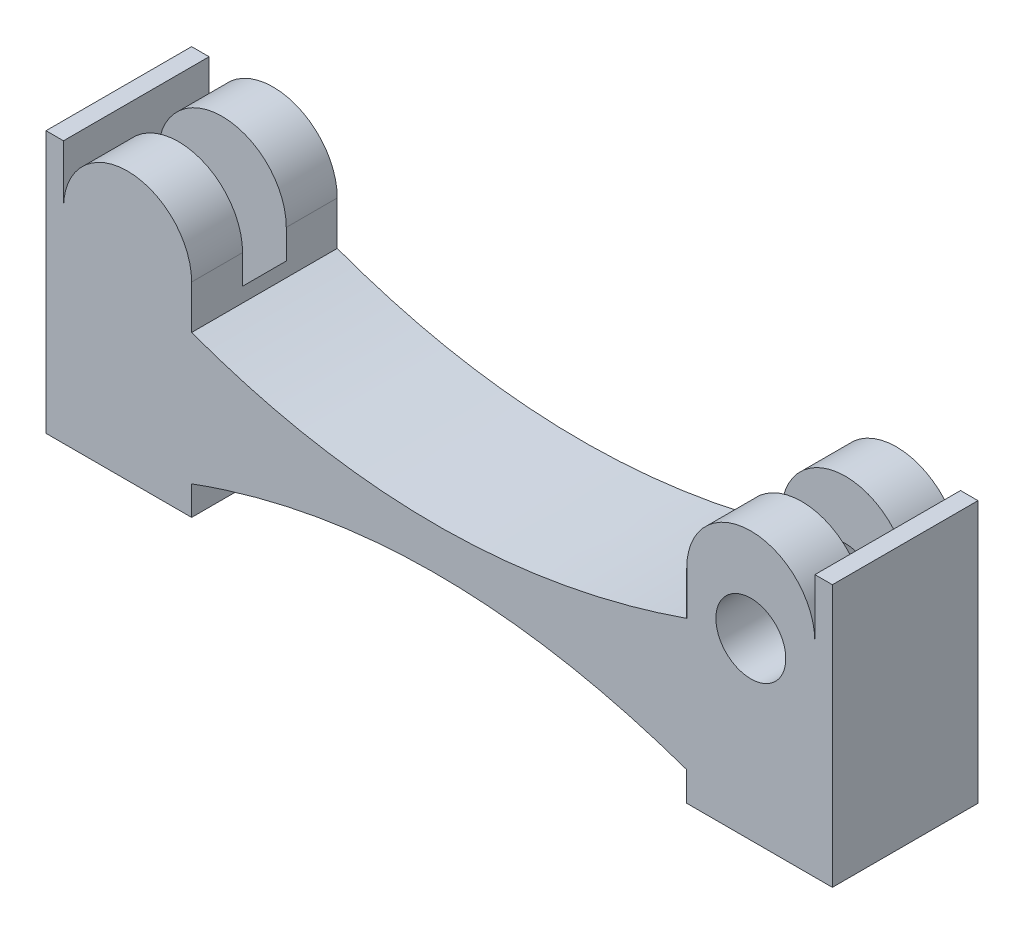
ISO-10303-21;
HEADER;
FILE_DESCRIPTION(('STEP AP214'),'2;1');
FILE_NAME('part.step','',(''),(''),'','','');
FILE_SCHEMA(('AUTOMOTIVE_DESIGN { 1 0 10303 214 1 1 1 1 }'));
ENDSEC;
DATA;
#1=APPLICATION_CONTEXT('core data for automotive mechanical design processes');
#2=APPLICATION_PROTOCOL_DEFINITION('international standard','automotive_design',2000,#1);
#3=PRODUCT_CONTEXT('',#1,'mechanical');
#4=PRODUCT('Part','Part','',(#3));
#5=PRODUCT_RELATED_PRODUCT_CATEGORY('part','',(#4));
#6=PRODUCT_DEFINITION_FORMATION('','',#4);
#7=PRODUCT_DEFINITION_CONTEXT('part definition',#1,'design');
#8=PRODUCT_DEFINITION('design','',#6,#7);
#9=PRODUCT_DEFINITION_SHAPE('','',#8);
#10=(LENGTH_UNIT() NAMED_UNIT(*) SI_UNIT(.MILLI.,.METRE.));
#11=(NAMED_UNIT(*) PLANE_ANGLE_UNIT() SI_UNIT($,.RADIAN.));
#12=(NAMED_UNIT(*) SI_UNIT($,.STERADIAN.) SOLID_ANGLE_UNIT());
#13=UNCERTAINTY_MEASURE_WITH_UNIT(LENGTH_MEASURE(1.E-05),#10,'distance_accuracy_value','');
#14=(GEOMETRIC_REPRESENTATION_CONTEXT(3) GLOBAL_UNCERTAINTY_ASSIGNED_CONTEXT((#13)) GLOBAL_UNIT_ASSIGNED_CONTEXT((#10,
#11,#12)) REPRESENTATION_CONTEXT('',''));
#15=CARTESIAN_POINT('',(0.,0.,0.));
#16=DIRECTION('',(0.,0.,1.));
#17=DIRECTION('',(1.,0.,0.));
#18=AXIS2_PLACEMENT_3D('',#15,#16,#17);
#19=CARTESIAN_POINT('',(11.,30.,0.));
#20=DIRECTION('',(0.,0.,-1.));
#21=DIRECTION('',(-1.,0.,0.));
#22=AXIS2_PLACEMENT_3D('',#19,#20,#21);
#23=PLANE('',#22);
#24=CARTESIAN_POINT('',(11.,30.,0.));
#25=DIRECTION('',(0.,0.,-1.));
#26=DIRECTION('',(-1.,0.,0.));
#27=AXIS2_PLACEMENT_3D('',#24,#25,#26);
#28=CIRCLE('',#27,6.);
#29=CARTESIAN_POINT('',(5.,30.,0.));
#30=VERTEX_POINT('',#29);
#31=EDGE_CURVE('E46',#30,#30,#28,.T.);
#32=ORIENTED_EDGE('',*,*,#31,.T.);
#33=EDGE_LOOP('',(#32));
#34=FACE_BOUND('',#33,.T.);
#35=DIRECTION('',(0.,1.,0.));
#36=VECTOR('',#35,1.);
#37=CARTESIAN_POINT('',(0.,30.,0.));
#38=LINE('',#37,#36);
#39=CARTESIAN_POINT('',(0.,27.5,0.));
#40=VERTEX_POINT('',#39);
#41=CARTESIAN_POINT('',(0.,35.,0.));
#42=VERTEX_POINT('',#41);
#43=EDGE_CURVE('E433',#40,#42,#38,.T.);
#44=ORIENTED_EDGE('',*,*,#43,.F.);
#45=CARTESIAN_POINT('',(-85.,27.5,0.));
#46=CARTESIAN_POINT('',(-43.5735742321877,12.2657288947168,0.));
#47=CARTESIAN_POINT('',(0.,27.5,0.));
#48=B_SPLINE_CURVE_WITH_KNOTS('',2,(#45,#46,#47),.UNSPECIFIED.,.F.,.F.,(3,3),(0.,1.),.UNSPECIFIED.);
#49=CARTESIAN_POINT('',(-85.,27.5,0.));
#50=VERTEX_POINT('',#49);
#51=EDGE_CURVE('E348',#50,#40,#48,.T.);
#52=ORIENTED_EDGE('',*,*,#51,.F.);
#53=DIRECTION('',(0.,-1.,0.));
#54=VECTOR('',#53,1.);
#55=CARTESIAN_POINT('',(-85.,0.,0.));
#56=LINE('',#55,#54);
#57=CARTESIAN_POINT('',(-85.,35.,0.));
#58=VERTEX_POINT('',#57);
#59=EDGE_CURVE('E331',#58,#50,#56,.T.);
#60=ORIENTED_EDGE('',*,*,#59,.F.);
#61=CARTESIAN_POINT('',(-96.,35.,0.));
#62=DIRECTION('',(0.,0.,-1.));
#63=DIRECTION('',(-1.,0.,0.));
#64=AXIS2_PLACEMENT_3D('',#61,#62,#63);
#65=CIRCLE('',#64,11.);
#66=CARTESIAN_POINT('',(-107.,35.,0.));
#67=VERTEX_POINT('',#66);
#68=EDGE_CURVE('E261',#67,#58,#65,.T.);
#69=ORIENTED_EDGE('',*,*,#68,.F.);
#70=DIRECTION('',(0.,-1.,0.));
#71=VECTOR('',#70,1.);
#72=CARTESIAN_POINT('',(-107.,0.,0.));
#73=LINE('',#72,#71);
#74=CARTESIAN_POINT('',(-107.,45.,0.));
#75=VERTEX_POINT('',#74);
#76=EDGE_CURVE('E236',#75,#67,#73,.T.);
#77=ORIENTED_EDGE('',*,*,#76,.F.);
#78=DIRECTION('',(1.,0.,0.));
#79=VECTOR('',#78,1.);
#80=CARTESIAN_POINT('',(-107.,45.,0.));
#81=LINE('',#80,#79);
#82=CARTESIAN_POINT('',(-110.,45.,0.));
#83=VERTEX_POINT('',#82);
#84=EDGE_CURVE('E243',#83,#75,#81,.T.);
#85=ORIENTED_EDGE('',*,*,#84,.F.);
#86=DIRECTION('',(0.,1.,0.));
#87=VECTOR('',#86,1.);
#88=CARTESIAN_POINT('',(-110.,0.,0.));
#89=LINE('',#88,#87);
#90=CARTESIAN_POINT('',(-110.,0.,0.));
#91=VERTEX_POINT('',#90);
#92=EDGE_CURVE('E239',#91,#83,#89,.T.);
#93=ORIENTED_EDGE('',*,*,#92,.F.);
#94=DIRECTION('',(-1.,0.,0.));
#95=VECTOR('',#94,1.);
#96=CARTESIAN_POINT('',(-85.,0.,0.));
#97=LINE('',#96,#95);
#98=CARTESIAN_POINT('',(-85.,0.,0.));
#99=VERTEX_POINT('',#98);
#100=EDGE_CURVE('E333',#99,#91,#97,.T.);
#101=ORIENTED_EDGE('',*,*,#100,.F.);
#102=CARTESIAN_POINT('',(-85.,5.,0.));
#103=VERTEX_POINT('',#102);
#104=EDGE_CURVE('E334',#103,#99,#56,.T.);
#105=ORIENTED_EDGE('',*,*,#104,.F.);
#106=CARTESIAN_POINT('',(0.,5.,0.));
#107=CARTESIAN_POINT('',(-43.4351216094378,20.2349120752058,0.));
#108=CARTESIAN_POINT('',(-85.,5.,0.));
#109=B_SPLINE_CURVE_WITH_KNOTS('',2,(#106,#107,#108),.UNSPECIFIED.,.F.,.F.,(3,3),(0.,1.),.UNSPECIFIED.);
#110=CARTESIAN_POINT('',(0.,5.,0.));
#111=VERTEX_POINT('',#110);
#112=EDGE_CURVE('E354',#111,#103,#109,.T.);
#113=ORIENTED_EDGE('',*,*,#112,.F.);
#114=DIRECTION('',(0.,-1.,0.));
#115=VECTOR('',#114,1.);
#116=CARTESIAN_POINT('',(0.,30.,0.));
#117=LINE('',#116,#115);
#118=CARTESIAN_POINT('',(0.,0.,0.));
#119=VERTEX_POINT('',#118);
#120=EDGE_CURVE('E419',#111,#119,#117,.T.);
#121=ORIENTED_EDGE('',*,*,#120,.T.);
#122=DIRECTION('',(1.,0.,0.));
#123=VECTOR('',#122,1.);
#124=CARTESIAN_POINT('',(0.,0.,0.));
#125=LINE('',#124,#123);
#126=CARTESIAN_POINT('',(25.,0.,0.));
#127=VERTEX_POINT('',#126);
#128=EDGE_CURVE('E207',#119,#127,#125,.T.);
#129=ORIENTED_EDGE('',*,*,#128,.T.);
#130=DIRECTION('',(0.,-1.,0.));
#131=VECTOR('',#130,1.);
#132=CARTESIAN_POINT('',(25.,0.,0.));
#133=LINE('',#132,#131);
#134=CARTESIAN_POINT('',(25.,45.,0.));
#135=VERTEX_POINT('',#134);
#136=EDGE_CURVE('E215',#135,#127,#133,.T.);
#137=ORIENTED_EDGE('',*,*,#136,.F.);
#138=DIRECTION('',(1.,0.,0.));
#139=VECTOR('',#138,1.);
#140=CARTESIAN_POINT('',(22.,45.,0.));
#141=LINE('',#140,#139);
#142=CARTESIAN_POINT('',(22.,45.,0.));
#143=VERTEX_POINT('',#142);
#144=EDGE_CURVE('E226',#143,#135,#141,.T.);
#145=ORIENTED_EDGE('',*,*,#144,.F.);
#146=DIRECTION('',(0.,1.,0.));
#147=VECTOR('',#146,1.);
#148=CARTESIAN_POINT('',(22.,0.,0.));
#149=LINE('',#148,#147);
#150=CARTESIAN_POINT('',(22.,35.,0.));
#151=VERTEX_POINT('',#150);
#152=EDGE_CURVE('E222',#151,#143,#149,.T.);
#153=ORIENTED_EDGE('',*,*,#152,.F.);
#154=CARTESIAN_POINT('',(11.,35.,0.));
#155=DIRECTION('',(0.,0.,-1.));
#156=DIRECTION('',(-1.,0.,0.));
#157=AXIS2_PLACEMENT_3D('',#154,#155,#156);
#158=CIRCLE('',#157,11.);
#159=EDGE_CURVE('E427',#42,#151,#158,.T.);
#160=ORIENTED_EDGE('',*,*,#159,.F.);
#161=EDGE_LOOP('',(#44,#52,#60,#69,#77,#85,#93,#101,#105,#113,#121,#129,#137,#145,#153,#160));
#162=FACE_BOUND('',#161,.T.);
#163=ADVANCED_FACE('F38',(#34,#162),#23,.F.);
#164=CARTESIAN_POINT('',(11.,30.,0.));
#165=DIRECTION('',(0.,0.,-1.));
#166=DIRECTION('',(-1.,0.,0.));
#167=AXIS2_PLACEMENT_3D('',#164,#165,#166);
#168=CYLINDRICAL_SURFACE('',#167,6.);
#169=ORIENTED_EDGE('',*,*,#31,.F.);
#170=EDGE_LOOP('',(#169));
#171=FACE_BOUND('',#170,.T.);
#172=CARTESIAN_POINT('',(11.,30.,-8.75));
#173=DIRECTION('',(0.,0.,-1.));
#174=DIRECTION('',(-1.,0.,0.));
#175=AXIS2_PLACEMENT_3D('',#172,#173,#174);
#176=CIRCLE('',#175,6.);
#177=CARTESIAN_POINT('',(5.,30.,-8.75));
#178=VERTEX_POINT('',#177);
#179=EDGE_CURVE('E11',#178,#178,#176,.F.);
#180=ORIENTED_EDGE('',*,*,#179,.F.);
#181=EDGE_LOOP('',(#180));
#182=FACE_BOUND('',#181,.T.);
#183=ADVANCED_FACE('F388',(#171,#182),#168,.F.);
#184=CARTESIAN_POINT('',(11.,30.,-8.75));
#185=DIRECTION('',(0.,0.,-1.));
#186=DIRECTION('',(-1.,0.,0.));
#187=AXIS2_PLACEMENT_3D('',#184,#185,#186);
#188=PLANE('',#187);
#189=ORIENTED_EDGE('',*,*,#179,.T.);
#190=EDGE_LOOP('',(#189));
#191=FACE_BOUND('',#190,.T.);
#192=CARTESIAN_POINT('',(11.,30.,-8.75));
#193=DIRECTION('',(0.,0.,-1.));
#194=DIRECTION('',(-1.,0.,0.));
#195=AXIS2_PLACEMENT_3D('',#192,#193,#194);
#196=CIRCLE('',#195,11.);
#197=CARTESIAN_POINT('',(22.,30.,-8.75));
#198=VERTEX_POINT('',#197);
#199=CARTESIAN_POINT('',(0.,30.,-8.75));
#200=VERTEX_POINT('',#199);
#201=EDGE_CURVE('E311',#198,#200,#196,.T.);
#202=ORIENTED_EDGE('',*,*,#201,.T.);
#203=DIRECTION('',(0.,1.,0.));
#204=VECTOR('',#203,1.);
#205=CARTESIAN_POINT('',(0.,30.,-8.75));
#206=LINE('',#205,#204);
#207=CARTESIAN_POINT('',(0.,35.,-8.75));
#208=VERTEX_POINT('',#207);
#209=EDGE_CURVE('E436',#200,#208,#206,.T.);
#210=ORIENTED_EDGE('',*,*,#209,.T.);
#211=CARTESIAN_POINT('',(11.,35.,-8.75));
#212=DIRECTION('',(0.,0.,-1.));
#213=DIRECTION('',(-1.,0.,0.));
#214=AXIS2_PLACEMENT_3D('',#211,#212,#213);
#215=CIRCLE('',#214,11.);
#216=CARTESIAN_POINT('',(22.,35.,-8.75));
#217=VERTEX_POINT('',#216);
#218=EDGE_CURVE('E432',#208,#217,#215,.T.);
#219=ORIENTED_EDGE('',*,*,#218,.T.);
#220=DIRECTION('',(0.,-1.,0.));
#221=VECTOR('',#220,1.);
#222=CARTESIAN_POINT('',(22.,35.,-8.75));
#223=LINE('',#222,#221);
#224=EDGE_CURVE('E429',#217,#198,#223,.T.);
#225=ORIENTED_EDGE('',*,*,#224,.T.);
#226=EDGE_LOOP('',(#202,#210,#219,#225));
#227=FACE_BOUND('',#226,.T.);
#228=ADVANCED_FACE('F385',(#191,#227),#188,.T.);
#229=CARTESIAN_POINT('',(11.,35.,0.));
#230=DIRECTION('',(0.,0.,-1.));
#231=DIRECTION('',(-1.,0.,0.));
#232=AXIS2_PLACEMENT_3D('',#229,#230,#231);
#233=CYLINDRICAL_SURFACE('',#232,11.);
#234=ORIENTED_EDGE('',*,*,#218,.F.);
#235=DIRECTION('',(0.,0.,-1.));
#236=VECTOR('',#235,1.);
#237=CARTESIAN_POINT('',(0.,35.,0.));
#238=LINE('',#237,#236);
#239=EDGE_CURVE('E52',#42,#208,#238,.T.);
#240=ORIENTED_EDGE('',*,*,#239,.F.);
#241=ORIENTED_EDGE('',*,*,#159,.T.);
#242=DIRECTION('',(0.,0.,-1.));
#243=VECTOR('',#242,1.);
#244=CARTESIAN_POINT('',(22.,35.,0.));
#245=LINE('',#244,#243);
#246=EDGE_CURVE('E418',#151,#217,#245,.T.);
#247=ORIENTED_EDGE('',*,*,#246,.T.);
#248=EDGE_LOOP('',(#234,#240,#241,#247));
#249=FACE_BOUND('',#248,.T.);
#250=ADVANCED_FACE('F382',(#249),#233,.T.);
#251=CARTESIAN_POINT('',(0.,30.,0.));
#252=DIRECTION('',(-1.,0.,0.));
#253=DIRECTION('',(0.,0.,1.));
#254=AXIS2_PLACEMENT_3D('',#251,#252,#253);
#255=PLANE('',#254);
#256=ORIENTED_EDGE('',*,*,#209,.F.);
#257=DIRECTION('',(0.,0.,1.));
#258=VECTOR('',#257,1.);
#259=CARTESIAN_POINT('',(0.,30.,-16.25));
#260=LINE('',#259,#258);
#261=CARTESIAN_POINT('',(0.,30.,-16.25));
#262=VERTEX_POINT('',#261);
#263=EDGE_CURVE('E324',#200,#262,#260,.F.);
#264=ORIENTED_EDGE('',*,*,#263,.T.);
#265=DIRECTION('',(0.,1.,0.));
#266=VECTOR('',#265,1.);
#267=CARTESIAN_POINT('',(0.,35.,-16.25));
#268=LINE('',#267,#266);
#269=CARTESIAN_POINT('',(0.,35.,-16.25));
#270=VERTEX_POINT('',#269);
#271=EDGE_CURVE('E281',#262,#270,#268,.T.);
#272=ORIENTED_EDGE('',*,*,#271,.T.);
#273=DIRECTION('',(0.,0.,-1.));
#274=VECTOR('',#273,1.);
#275=CARTESIAN_POINT('',(0.,35.,-16.25));
#276=LINE('',#275,#274);
#277=CARTESIAN_POINT('',(0.,35.,-25.));
#278=VERTEX_POINT('',#277);
#279=EDGE_CURVE('E287',#270,#278,#276,.T.);
#280=ORIENTED_EDGE('',*,*,#279,.T.);
#281=DIRECTION('',(0.,-1.,0.));
#282=VECTOR('',#281,1.);
#283=CARTESIAN_POINT('',(0.,30.,-25.));
#284=LINE('',#283,#282);
#285=CARTESIAN_POINT('',(0.,27.5,-25.));
#286=VERTEX_POINT('',#285);
#287=EDGE_CURVE('E423',#278,#286,#284,.T.);
#288=ORIENTED_EDGE('',*,*,#287,.T.);
#289=DIRECTION('',(0.,0.,-1.));
#290=VECTOR('',#289,1.);
#291=CARTESIAN_POINT('',(0.,27.5,0.));
#292=LINE('',#291,#290);
#293=EDGE_CURVE('E449',#40,#286,#292,.T.);
#294=ORIENTED_EDGE('',*,*,#293,.F.);
#295=ORIENTED_EDGE('',*,*,#43,.T.);
#296=ORIENTED_EDGE('',*,*,#239,.T.);
#297=EDGE_LOOP('',(#256,#264,#272,#280,#288,#294,#295,#296));
#298=FACE_BOUND('',#297,.T.);
#299=ADVANCED_FACE('F378',(#298),#255,.T.);
#300=CARTESIAN_POINT('',(0.,30.,0.));
#301=DIRECTION('',(1.,0.,0.));
#302=DIRECTION('',(0.,0.,-1.));
#303=AXIS2_PLACEMENT_3D('',#300,#301,#302);
#304=PLANE('',#303);
#305=ORIENTED_EDGE('',*,*,#120,.F.);
#306=DIRECTION('',(0.,0.,-1.));
#307=VECTOR('',#306,1.);
#308=CARTESIAN_POINT('',(0.,5.,0.));
#309=LINE('',#308,#307);
#310=CARTESIAN_POINT('',(0.,5.,-25.));
#311=VERTEX_POINT('',#310);
#312=EDGE_CURVE('E453',#111,#311,#309,.T.);
#313=ORIENTED_EDGE('',*,*,#312,.T.);
#314=CARTESIAN_POINT('',(0.,0.,-25.));
#315=VERTEX_POINT('',#314);
#316=EDGE_CURVE('E463',#311,#315,#284,.T.);
#317=ORIENTED_EDGE('',*,*,#316,.T.);
#318=DIRECTION('',(0.,0.,1.));
#319=VECTOR('',#318,1.);
#320=CARTESIAN_POINT('',(0.,0.,0.));
#321=LINE('',#320,#319);
#322=EDGE_CURVE('E202',#315,#119,#321,.T.);
#323=ORIENTED_EDGE('',*,*,#322,.T.);
#324=EDGE_LOOP('',(#305,#313,#317,#323));
#325=FACE_BOUND('',#324,.T.);
#326=ADVANCED_FACE('F375',(#325),#304,.F.);
#327=CARTESIAN_POINT('',(0.,30.,-25.));
#328=DIRECTION('',(0.,0.,1.));
#329=DIRECTION('',(1.,0.,0.));
#330=AXIS2_PLACEMENT_3D('',#327,#328,#329);
#331=PLANE('',#330);
#332=ORIENTED_EDGE('',*,*,#287,.F.);
#333=CARTESIAN_POINT('',(11.,35.,-25.));
#334=DIRECTION('',(0.,0.,-1.));
#335=DIRECTION('',(-1.,0.,0.));
#336=AXIS2_PLACEMENT_3D('',#333,#334,#335);
#337=CIRCLE('',#336,11.);
#338=CARTESIAN_POINT('',(22.,35.,-25.));
#339=VERTEX_POINT('',#338);
#340=EDGE_CURVE('E273',#278,#339,#337,.T.);
#341=ORIENTED_EDGE('',*,*,#340,.T.);
#342=DIRECTION('',(0.,1.,0.));
#343=VECTOR('',#342,1.);
#344=CARTESIAN_POINT('',(22.,0.,-25.));
#345=LINE('',#344,#343);
#346=CARTESIAN_POINT('',(22.,45.,-25.));
#347=VERTEX_POINT('',#346);
#348=EDGE_CURVE('E224',#339,#347,#345,.T.);
#349=ORIENTED_EDGE('',*,*,#348,.T.);
#350=DIRECTION('',(1.,0.,0.));
#351=VECTOR('',#350,1.);
#352=CARTESIAN_POINT('',(22.,45.,-25.));
#353=LINE('',#352,#351);
#354=CARTESIAN_POINT('',(25.,45.,-25.));
#355=VERTEX_POINT('',#354);
#356=EDGE_CURVE('E221',#347,#355,#353,.T.);
#357=ORIENTED_EDGE('',*,*,#356,.T.);
#358=DIRECTION('',(0.,-1.,0.));
#359=VECTOR('',#358,1.);
#360=CARTESIAN_POINT('',(25.,0.,-25.));
#361=LINE('',#360,#359);
#362=CARTESIAN_POINT('',(25.,0.,-25.));
#363=VERTEX_POINT('',#362);
#364=EDGE_CURVE('E212',#355,#363,#361,.T.);
#365=ORIENTED_EDGE('',*,*,#364,.T.);
#366=DIRECTION('',(-1.,0.,0.));
#367=VECTOR('',#366,1.);
#368=CARTESIAN_POINT('',(0.,0.,-25.));
#369=LINE('',#368,#367);
#370=EDGE_CURVE('E195',#363,#315,#369,.T.);
#371=ORIENTED_EDGE('',*,*,#370,.T.);
#372=ORIENTED_EDGE('',*,*,#316,.F.);
#373=CARTESIAN_POINT('',(0.,5.,-25.));
#374=CARTESIAN_POINT('',(-43.4351216094378,20.2349120752058,-25.));
#375=CARTESIAN_POINT('',(-85.,5.,-25.));
#376=B_SPLINE_CURVE_WITH_KNOTS('',2,(#373,#374,#375),.UNSPECIFIED.,.F.,.F.,(3,3),(0.,1.),.UNSPECIFIED.);
#377=CARTESIAN_POINT('',(-85.,5.,-25.));
#378=VERTEX_POINT('',#377);
#379=EDGE_CURVE('E355',#311,#378,#376,.T.);
#380=ORIENTED_EDGE('',*,*,#379,.T.);
#381=DIRECTION('',(0.,-1.,0.));
#382=VECTOR('',#381,1.);
#383=CARTESIAN_POINT('',(-85.,0.,-25.));
#384=LINE('',#383,#382);
#385=CARTESIAN_POINT('',(-85.,0.,-25.));
#386=VERTEX_POINT('',#385);
#387=EDGE_CURVE('E330',#378,#386,#384,.T.);
#388=ORIENTED_EDGE('',*,*,#387,.T.);
#389=DIRECTION('',(-1.,0.,0.));
#390=VECTOR('',#389,1.);
#391=CARTESIAN_POINT('',(-85.,0.,-25.));
#392=LINE('',#391,#390);
#393=CARTESIAN_POINT('',(-110.,0.,-25.));
#394=VERTEX_POINT('',#393);
#395=EDGE_CURVE('E340',#386,#394,#392,.T.);
#396=ORIENTED_EDGE('',*,*,#395,.T.);
#397=DIRECTION('',(0.,1.,0.));
#398=VECTOR('',#397,1.);
#399=CARTESIAN_POINT('',(-110.,0.,-25.));
#400=LINE('',#399,#398);
#401=CARTESIAN_POINT('',(-110.,45.,-25.));
#402=VERTEX_POINT('',#401);
#403=EDGE_CURVE('E249',#394,#402,#400,.T.);
#404=ORIENTED_EDGE('',*,*,#403,.T.);
#405=DIRECTION('',(1.,0.,0.));
#406=VECTOR('',#405,1.);
#407=CARTESIAN_POINT('',(-107.,45.,-25.));
#408=LINE('',#407,#406);
#409=CARTESIAN_POINT('',(-107.,45.,-25.));
#410=VERTEX_POINT('',#409);
#411=EDGE_CURVE('E240',#402,#410,#408,.T.);
#412=ORIENTED_EDGE('',*,*,#411,.T.);
#413=DIRECTION('',(0.,-1.,0.));
#414=VECTOR('',#413,1.);
#415=CARTESIAN_POINT('',(-107.,0.,-25.));
#416=LINE('',#415,#414);
#417=CARTESIAN_POINT('',(-107.,35.,-25.));
#418=VERTEX_POINT('',#417);
#419=EDGE_CURVE('E231',#410,#418,#416,.T.);
#420=ORIENTED_EDGE('',*,*,#419,.T.);
#421=CARTESIAN_POINT('',(-96.,35.,-25.));
#422=DIRECTION('',(0.,0.,-1.));
#423=DIRECTION('',(1.,0.,0.));
#424=AXIS2_PLACEMENT_3D('',#421,#422,#423);
#425=CIRCLE('',#424,11.);
#426=CARTESIAN_POINT('',(-85.,35.,-25.));
#427=VERTEX_POINT('',#426);
#428=EDGE_CURVE('E299',#418,#427,#425,.T.);
#429=ORIENTED_EDGE('',*,*,#428,.T.);
#430=CARTESIAN_POINT('',(-85.,27.5,-25.));
#431=VERTEX_POINT('',#430);
#432=EDGE_CURVE('E337',#427,#431,#384,.T.);
#433=ORIENTED_EDGE('',*,*,#432,.T.);
#434=CARTESIAN_POINT('',(-85.,27.5,-25.));
#435=CARTESIAN_POINT('',(-43.5735742321877,12.2657288947168,-25.));
#436=CARTESIAN_POINT('',(0.,27.5,-25.));
#437=B_SPLINE_CURVE_WITH_KNOTS('',2,(#434,#435,#436),.UNSPECIFIED.,.F.,.F.,(3,3),(0.,1.),.UNSPECIFIED.);
#438=EDGE_CURVE('E345',#431,#286,#437,.T.);
#439=ORIENTED_EDGE('',*,*,#438,.T.);
#440=EDGE_LOOP('',(#332,#341,#349,#357,#365,#371,#372,#380,#388,#396,#404,#412,#420,#429,#433,#439));
#441=FACE_BOUND('',#440,.T.);
#442=CARTESIAN_POINT('',(11.,30.,-25.));
#443=DIRECTION('',(0.,0.,-1.));
#444=DIRECTION('',(-1.,0.,0.));
#445=AXIS2_PLACEMENT_3D('',#442,#443,#444);
#446=CIRCLE('',#445,6.);
#447=CARTESIAN_POINT('',(5.,30.,-25.));
#448=VERTEX_POINT('',#447);
#449=EDGE_CURVE('E327',#448,#448,#446,.T.);
#450=ORIENTED_EDGE('',*,*,#449,.F.);
#451=EDGE_LOOP('',(#450));
#452=FACE_BOUND('',#451,.T.);
#453=ADVANCED_FACE('F218',(#441,#452),#331,.F.);
#454=CARTESIAN_POINT('',(0.,0.,0.));
#455=DIRECTION('',(0.,-1.,0.));
#456=DIRECTION('',(0.,0.,-1.));
#457=AXIS2_PLACEMENT_3D('',#454,#455,#456);
#458=PLANE('',#457);
#459=ORIENTED_EDGE('',*,*,#322,.F.);
#460=ORIENTED_EDGE('',*,*,#370,.F.);
#461=DIRECTION('',(0.,0.,-1.));
#462=VECTOR('',#461,1.);
#463=CARTESIAN_POINT('',(25.,0.,0.));
#464=LINE('',#463,#462);
#465=EDGE_CURVE('E199',#127,#363,#464,.T.);
#466=ORIENTED_EDGE('',*,*,#465,.F.);
#467=ORIENTED_EDGE('',*,*,#128,.F.);
#468=EDGE_LOOP('',(#459,#460,#466,#467));
#469=FACE_BOUND('',#468,.T.);
#470=ADVANCED_FACE('F197',(#469),#458,.T.);
#471=DIRECTION('',(0.,0.,-1.));
#472=VECTOR('',#471,1.);
#473=SURFACE_OF_LINEAR_EXTRUSION('',#48,#472);
#474=ORIENTED_EDGE('',*,*,#438,.F.);
#475=DIRECTION('',(0.,0.,-1.));
#476=VECTOR('',#475,1.);
#477=CARTESIAN_POINT('',(-85.,27.5,0.));
#478=LINE('',#477,#476);
#479=EDGE_CURVE('E451',#50,#431,#478,.T.);
#480=ORIENTED_EDGE('',*,*,#479,.F.);
#481=ORIENTED_EDGE('',*,*,#51,.T.);
#482=ORIENTED_EDGE('',*,*,#293,.T.);
#483=EDGE_LOOP('',(#474,#480,#481,#482));
#484=FACE_BOUND('',#483,.T.);
#485=ADVANCED_FACE('F364',(#484),#473,.T.);
#486=DIRECTION('',(0.,0.,-1.));
#487=VECTOR('',#486,1.);
#488=SURFACE_OF_LINEAR_EXTRUSION('',#109,#487);
#489=ORIENTED_EDGE('',*,*,#379,.F.);
#490=ORIENTED_EDGE('',*,*,#312,.F.);
#491=ORIENTED_EDGE('',*,*,#112,.T.);
#492=DIRECTION('',(0.,0.,-1.));
#493=VECTOR('',#492,1.);
#494=CARTESIAN_POINT('',(-85.,5.,0.));
#495=LINE('',#494,#493);
#496=EDGE_CURVE('E456',#103,#378,#495,.T.);
#497=ORIENTED_EDGE('',*,*,#496,.T.);
#498=EDGE_LOOP('',(#489,#490,#491,#497));
#499=FACE_BOUND('',#498,.T.);
#500=ADVANCED_FACE('F368',(#499),#488,.T.);
#501=CARTESIAN_POINT('',(-85.,0.,0.));
#502=DIRECTION('',(1.,0.,0.));
#503=DIRECTION('',(0.,0.,-1.));
#504=AXIS2_PLACEMENT_3D('',#501,#502,#503);
#505=PLANE('',#504);
#506=ORIENTED_EDGE('',*,*,#59,.T.);
#507=ORIENTED_EDGE('',*,*,#479,.T.);
#508=ORIENTED_EDGE('',*,*,#432,.F.);
#509=DIRECTION('',(0.,0.,-1.));
#510=VECTOR('',#509,1.);
#511=CARTESIAN_POINT('',(-85.,35.,-16.25));
#512=LINE('',#511,#510);
#513=CARTESIAN_POINT('',(-85.,35.,-16.25));
#514=VERTEX_POINT('',#513);
#515=EDGE_CURVE('E293',#514,#427,#512,.T.);
#516=ORIENTED_EDGE('',*,*,#515,.F.);
#517=DIRECTION('',(0.,-1.,0.));
#518=VECTOR('',#517,1.);
#519=CARTESIAN_POINT('',(-85.,35.,-16.25));
#520=LINE('',#519,#518);
#521=CARTESIAN_POINT('',(-85.,30.,-16.25));
#522=VERTEX_POINT('',#521);
#523=EDGE_CURVE('E306',#514,#522,#520,.T.);
#524=ORIENTED_EDGE('',*,*,#523,.T.);
#525=DIRECTION('',(0.,0.,1.));
#526=VECTOR('',#525,1.);
#527=CARTESIAN_POINT('',(-85.,30.000000000351,-16.25));
#528=LINE('',#527,#526);
#529=CARTESIAN_POINT('',(-85.,30.000000000351,-8.75));
#530=VERTEX_POINT('',#529);
#531=EDGE_CURVE('E318',#530,#522,#528,.F.);
#532=ORIENTED_EDGE('',*,*,#531,.F.);
#533=DIRECTION('',(0.,-1.,0.));
#534=VECTOR('',#533,1.);
#535=CARTESIAN_POINT('',(-85.,35.,-8.75));
#536=LINE('',#535,#534);
#537=CARTESIAN_POINT('',(-85.,35.,-8.75));
#538=VERTEX_POINT('',#537);
#539=EDGE_CURVE('E265',#538,#530,#536,.T.);
#540=ORIENTED_EDGE('',*,*,#539,.F.);
#541=DIRECTION('',(0.,0.,-1.));
#542=VECTOR('',#541,1.);
#543=CARTESIAN_POINT('',(-85.,35.,0.));
#544=LINE('',#543,#542);
#545=EDGE_CURVE('E271',#58,#538,#544,.T.);
#546=ORIENTED_EDGE('',*,*,#545,.F.);
#547=EDGE_LOOP('',(#506,#507,#508,#516,#524,#532,#540,#546));
#548=FACE_BOUND('',#547,.T.);
#549=ADVANCED_FACE('F502',(#548),#505,.T.);
#550=ORIENTED_EDGE('',*,*,#387,.F.);
#551=ORIENTED_EDGE('',*,*,#496,.F.);
#552=ORIENTED_EDGE('',*,*,#104,.T.);
#553=DIRECTION('',(0.,0.,-1.));
#554=VECTOR('',#553,1.);
#555=CARTESIAN_POINT('',(-85.,0.,0.));
#556=LINE('',#555,#554);
#557=EDGE_CURVE('E336',#99,#386,#556,.T.);
#558=ORIENTED_EDGE('',*,*,#557,.T.);
#559=EDGE_LOOP('',(#550,#551,#552,#558));
#560=FACE_BOUND('',#559,.T.);
#561=ADVANCED_FACE('F410',(#560),#505,.T.);
#562=CARTESIAN_POINT('',(-85.,0.,0.));
#563=DIRECTION('',(0.,-1.,0.));
#564=DIRECTION('',(0.,0.,-1.));
#565=AXIS2_PLACEMENT_3D('',#562,#563,#564);
#566=PLANE('',#565);
#567=ORIENTED_EDGE('',*,*,#395,.F.);
#568=ORIENTED_EDGE('',*,*,#557,.F.);
#569=ORIENTED_EDGE('',*,*,#100,.T.);
#570=DIRECTION('',(0.,0.,-1.));
#571=VECTOR('',#570,1.);
#572=CARTESIAN_POINT('',(-110.,0.,0.));
#573=LINE('',#572,#571);
#574=EDGE_CURVE('E246',#91,#394,#573,.T.);
#575=ORIENTED_EDGE('',*,*,#574,.T.);
#576=EDGE_LOOP('',(#567,#568,#569,#575));
#577=FACE_BOUND('',#576,.T.);
#578=ADVANCED_FACE('F401',(#577),#566,.T.);
#579=ORIENTED_EDGE('',*,*,#449,.T.);
#580=EDGE_LOOP('',(#579));
#581=FACE_BOUND('',#580,.T.);
#582=CARTESIAN_POINT('',(11.,30.,-16.25));
#583=DIRECTION('',(0.,0.,-1.));
#584=DIRECTION('',(-1.,0.,0.));
#585=AXIS2_PLACEMENT_3D('',#582,#583,#584);
#586=CIRCLE('',#585,6.);
#587=CARTESIAN_POINT('',(5.,30.,-16.25));
#588=VERTEX_POINT('',#587);
#589=EDGE_CURVE('E417',#588,#588,#586,.F.);
#590=ORIENTED_EDGE('',*,*,#589,.T.);
#591=EDGE_LOOP('',(#590));
#592=FACE_BOUND('',#591,.T.);
#593=ADVANCED_FACE('F392',(#581,#592),#168,.F.);
#594=CARTESIAN_POINT('',(11.,30.,-16.25));
#595=DIRECTION('',(0.,0.,-1.));
#596=DIRECTION('',(-1.,0.,0.));
#597=AXIS2_PLACEMENT_3D('',#594,#595,#596);
#598=PLANE('',#597);
#599=ORIENTED_EDGE('',*,*,#589,.F.);
#600=EDGE_LOOP('',(#599));
#601=FACE_BOUND('',#600,.T.);
#602=CARTESIAN_POINT('',(11.,30.,-16.25));
#603=DIRECTION('',(0.,0.,-1.));
#604=DIRECTION('',(-1.,0.,0.));
#605=AXIS2_PLACEMENT_3D('',#602,#603,#604);
#606=CIRCLE('',#605,11.);
#607=CARTESIAN_POINT('',(22.,30.,-16.25));
#608=VERTEX_POINT('',#607);
#609=EDGE_CURVE('E314',#608,#262,#606,.T.);
#610=ORIENTED_EDGE('',*,*,#609,.F.);
#611=DIRECTION('',(0.,-1.,0.));
#612=VECTOR('',#611,1.);
#613=CARTESIAN_POINT('',(22.,35.,-16.25));
#614=LINE('',#613,#612);
#615=CARTESIAN_POINT('',(22.,35.,-16.25));
#616=VERTEX_POINT('',#615);
#617=EDGE_CURVE('E279',#616,#608,#614,.T.);
#618=ORIENTED_EDGE('',*,*,#617,.F.);
#619=CARTESIAN_POINT('',(11.,35.,-16.25));
#620=DIRECTION('',(0.,0.,-1.));
#621=DIRECTION('',(-1.,0.,0.));
#622=AXIS2_PLACEMENT_3D('',#619,#620,#621);
#623=CIRCLE('',#622,11.);
#624=EDGE_CURVE('E276',#270,#616,#623,.T.);
#625=ORIENTED_EDGE('',*,*,#624,.F.);
#626=ORIENTED_EDGE('',*,*,#271,.F.);
#627=EDGE_LOOP('',(#610,#618,#625,#626));
#628=FACE_BOUND('',#627,.T.);
#629=ADVANCED_FACE('F400',(#601,#628),#598,.F.);
#630=CARTESIAN_POINT('',(11.,30.,-16.25));
#631=DIRECTION('',(0.,0.,1.));
#632=DIRECTION('',(1.,0.,0.));
#633=AXIS2_PLACEMENT_3D('',#630,#631,#632);
#634=CYLINDRICAL_SURFACE('',#633,11.);
#635=ORIENTED_EDGE('',*,*,#201,.F.);
#636=DIRECTION('',(0.,0.,-1.));
#637=VECTOR('',#636,1.);
#638=CARTESIAN_POINT('',(22.,30.,0.));
#639=LINE('',#638,#637);
#640=EDGE_CURVE('E206',#198,#608,#639,.T.);
#641=ORIENTED_EDGE('',*,*,#640,.T.);
#642=ORIENTED_EDGE('',*,*,#609,.T.);
#643=ORIENTED_EDGE('',*,*,#263,.F.);
#644=EDGE_LOOP('',(#635,#641,#642,#643));
#645=FACE_BOUND('',#644,.T.);
#646=ADVANCED_FACE('F407',(#645),#634,.F.);
#647=CARTESIAN_POINT('',(-96.,30.000000000351,-16.25));
#648=DIRECTION('',(0.,0.,1.));
#649=DIRECTION('',(1.,0.,0.));
#650=AXIS2_PLACEMENT_3D('',#647,#648,#649);
#651=CYLINDRICAL_SURFACE('',#650,11.);
#652=ORIENTED_EDGE('',*,*,#531,.T.);
#653=CARTESIAN_POINT('',(-96.,30.000000000351,-16.25));
#654=DIRECTION('',(0.,0.,-1.));
#655=DIRECTION('',(-1.,0.,0.));
#656=AXIS2_PLACEMENT_3D('',#653,#654,#655);
#657=CIRCLE('',#656,11.);
#658=CARTESIAN_POINT('',(-107.,30.,-16.25));
#659=VERTEX_POINT('',#658);
#660=EDGE_CURVE('E302',#522,#659,#657,.T.);
#661=ORIENTED_EDGE('',*,*,#660,.T.);
#662=DIRECTION('',(0.,0.,-1.));
#663=VECTOR('',#662,1.);
#664=CARTESIAN_POINT('',(-107.,30.,0.));
#665=LINE('',#664,#663);
#666=CARTESIAN_POINT('',(-107.,30.,-8.75));
#667=VERTEX_POINT('',#666);
#668=EDGE_CURVE('E342',#667,#659,#665,.T.);
#669=ORIENTED_EDGE('',*,*,#668,.F.);
#670=CARTESIAN_POINT('',(-96.,30.000000000351,-8.75));
#671=DIRECTION('',(0.,0.,-1.));
#672=DIRECTION('',(-1.,0.,0.));
#673=AXIS2_PLACEMENT_3D('',#670,#671,#672);
#674=CIRCLE('',#673,11.);
#675=EDGE_CURVE('E315',#530,#667,#674,.T.);
#676=ORIENTED_EDGE('',*,*,#675,.F.);
#677=EDGE_LOOP('',(#652,#661,#669,#676));
#678=FACE_BOUND('',#677,.T.);
#679=ADVANCED_FACE('F509',(#678),#651,.F.);
#680=CARTESIAN_POINT('',(-96.,30.000000000351,-16.25));
#681=DIRECTION('',(0.,0.,-1.));
#682=DIRECTION('',(-1.,0.,0.));
#683=AXIS2_PLACEMENT_3D('',#680,#681,#682);
#684=PLANE('',#683);
#685=ORIENTED_EDGE('',*,*,#660,.F.);
#686=ORIENTED_EDGE('',*,*,#523,.F.);
#687=CARTESIAN_POINT('',(-96.,35.,-16.25));
#688=DIRECTION('',(0.,0.,-1.));
#689=DIRECTION('',(1.,0.,0.));
#690=AXIS2_PLACEMENT_3D('',#687,#688,#689);
#691=CIRCLE('',#690,11.);
#692=CARTESIAN_POINT('',(-107.,35.,-16.25));
#693=VERTEX_POINT('',#692);
#694=EDGE_CURVE('E303',#693,#514,#691,.T.);
#695=ORIENTED_EDGE('',*,*,#694,.F.);
#696=DIRECTION('',(0.,1.,0.));
#697=VECTOR('',#696,1.);
#698=CARTESIAN_POINT('',(-107.,35.,-16.25));
#699=LINE('',#698,#697);
#700=EDGE_CURVE('E296',#659,#693,#699,.T.);
#701=ORIENTED_EDGE('',*,*,#700,.F.);
#702=EDGE_LOOP('',(#685,#686,#695,#701));
#703=FACE_BOUND('',#702,.T.);
#704=ADVANCED_FACE('F505',(#703),#684,.F.);
#705=CARTESIAN_POINT('',(-96.,30.000000000351,-8.75));
#706=DIRECTION('',(0.,0.,-1.));
#707=DIRECTION('',(-1.,0.,0.));
#708=AXIS2_PLACEMENT_3D('',#705,#706,#707);
#709=PLANE('',#708);
#710=ORIENTED_EDGE('',*,*,#675,.T.);
#711=DIRECTION('',(0.,1.,0.));
#712=VECTOR('',#711,1.);
#713=CARTESIAN_POINT('',(-107.,30.,-8.75));
#714=LINE('',#713,#712);
#715=CARTESIAN_POINT('',(-107.,35.,-8.75));
#716=VERTEX_POINT('',#715);
#717=EDGE_CURVE('E256',#667,#716,#714,.T.);
#718=ORIENTED_EDGE('',*,*,#717,.T.);
#719=CARTESIAN_POINT('',(-96.,35.,-8.75));
#720=DIRECTION('',(0.,0.,-1.));
#721=DIRECTION('',(-1.,0.,0.));
#722=AXIS2_PLACEMENT_3D('',#719,#720,#721);
#723=CIRCLE('',#722,11.);
#724=EDGE_CURVE('E267',#716,#538,#723,.T.);
#725=ORIENTED_EDGE('',*,*,#724,.T.);
#726=ORIENTED_EDGE('',*,*,#539,.T.);
#727=EDGE_LOOP('',(#710,#718,#725,#726));
#728=FACE_BOUND('',#727,.T.);
#729=ADVANCED_FACE('F513',(#728),#709,.T.);
#730=CARTESIAN_POINT('',(-96.,35.,-16.25));
#731=DIRECTION('',(0.,0.,-1.));
#732=DIRECTION('',(-1.,0.,0.));
#733=AXIS2_PLACEMENT_3D('',#730,#731,#732);
#734=CYLINDRICAL_SURFACE('',#733,11.);
#735=ORIENTED_EDGE('',*,*,#428,.F.);
#736=DIRECTION('',(0.,0.,-1.));
#737=VECTOR('',#736,1.);
#738=CARTESIAN_POINT('',(-107.,35.,-16.25));
#739=LINE('',#738,#737);
#740=EDGE_CURVE('E290',#693,#418,#739,.T.);
#741=ORIENTED_EDGE('',*,*,#740,.F.);
#742=ORIENTED_EDGE('',*,*,#694,.T.);
#743=ORIENTED_EDGE('',*,*,#515,.T.);
#744=EDGE_LOOP('',(#735,#741,#742,#743));
#745=FACE_BOUND('',#744,.T.);
#746=ADVANCED_FACE('F498',(#745),#734,.T.);
#747=CARTESIAN_POINT('',(11.,35.,-16.25));
#748=DIRECTION('',(0.,0.,-1.));
#749=DIRECTION('',(-1.,0.,0.));
#750=AXIS2_PLACEMENT_3D('',#747,#748,#749);
#751=CYLINDRICAL_SURFACE('',#750,11.);
#752=ORIENTED_EDGE('',*,*,#340,.F.);
#753=ORIENTED_EDGE('',*,*,#279,.F.);
#754=ORIENTED_EDGE('',*,*,#624,.T.);
#755=DIRECTION('',(0.,0.,-1.));
#756=VECTOR('',#755,1.);
#757=CARTESIAN_POINT('',(22.,35.,-16.25));
#758=LINE('',#757,#756);
#759=EDGE_CURVE('E284',#616,#339,#758,.T.);
#760=ORIENTED_EDGE('',*,*,#759,.T.);
#761=EDGE_LOOP('',(#752,#753,#754,#760));
#762=FACE_BOUND('',#761,.T.);
#763=ADVANCED_FACE('F520',(#762),#751,.T.);
#764=CARTESIAN_POINT('',(-96.,35.,0.));
#765=DIRECTION('',(0.,0.,-1.));
#766=DIRECTION('',(-1.,0.,0.));
#767=AXIS2_PLACEMENT_3D('',#764,#765,#766);
#768=CYLINDRICAL_SURFACE('',#767,11.);
#769=ORIENTED_EDGE('',*,*,#724,.F.);
#770=DIRECTION('',(0.,0.,-1.));
#771=VECTOR('',#770,1.);
#772=CARTESIAN_POINT('',(-107.,35.,0.));
#773=LINE('',#772,#771);
#774=EDGE_CURVE('E264',#67,#716,#773,.T.);
#775=ORIENTED_EDGE('',*,*,#774,.F.);
#776=ORIENTED_EDGE('',*,*,#68,.T.);
#777=ORIENTED_EDGE('',*,*,#545,.T.);
#778=EDGE_LOOP('',(#769,#775,#776,#777));
#779=FACE_BOUND('',#778,.T.);
#780=ADVANCED_FACE('F517',(#779),#768,.T.);
#781=CARTESIAN_POINT('',(-107.,0.,0.));
#782=DIRECTION('',(1.,0.,0.));
#783=DIRECTION('',(0.,1.,0.));
#784=AXIS2_PLACEMENT_3D('',#781,#782,#783);
#785=PLANE('',#784);
#786=ORIENTED_EDGE('',*,*,#740,.T.);
#787=ORIENTED_EDGE('',*,*,#419,.F.);
#788=DIRECTION('',(0.,0.,-1.));
#789=VECTOR('',#788,1.);
#790=CARTESIAN_POINT('',(-107.,45.,0.));
#791=LINE('',#790,#789);
#792=EDGE_CURVE('E254',#75,#410,#791,.T.);
#793=ORIENTED_EDGE('',*,*,#792,.F.);
#794=ORIENTED_EDGE('',*,*,#76,.T.);
#795=ORIENTED_EDGE('',*,*,#774,.T.);
#796=ORIENTED_EDGE('',*,*,#717,.F.);
#797=ORIENTED_EDGE('',*,*,#668,.T.);
#798=ORIENTED_EDGE('',*,*,#700,.T.);
#799=EDGE_LOOP('',(#786,#787,#793,#794,#795,#796,#797,#798));
#800=FACE_BOUND('',#799,.T.);
#801=ADVANCED_FACE('F496',(#800),#785,.T.);
#802=CARTESIAN_POINT('',(-107.,45.,0.));
#803=DIRECTION('',(0.,1.,0.));
#804=DIRECTION('',(0.,0.,1.));
#805=AXIS2_PLACEMENT_3D('',#802,#803,#804);
#806=PLANE('',#805);
#807=ORIENTED_EDGE('',*,*,#411,.F.);
#808=DIRECTION('',(0.,0.,-1.));
#809=VECTOR('',#808,1.);
#810=CARTESIAN_POINT('',(-110.,45.,0.));
#811=LINE('',#810,#809);
#812=EDGE_CURVE('E257',#83,#402,#811,.T.);
#813=ORIENTED_EDGE('',*,*,#812,.F.);
#814=ORIENTED_EDGE('',*,*,#84,.T.);
#815=ORIENTED_EDGE('',*,*,#792,.T.);
#816=EDGE_LOOP('',(#807,#813,#814,#815));
#817=FACE_BOUND('',#816,.T.);
#818=ADVANCED_FACE('F492',(#817),#806,.T.);
#819=CARTESIAN_POINT('',(-110.,0.,0.));
#820=DIRECTION('',(-1.,0.,0.));
#821=DIRECTION('',(0.,-1.,0.));
#822=AXIS2_PLACEMENT_3D('',#819,#820,#821);
#823=PLANE('',#822);
#824=ORIENTED_EDGE('',*,*,#403,.F.);
#825=ORIENTED_EDGE('',*,*,#574,.F.);
#826=ORIENTED_EDGE('',*,*,#92,.T.);
#827=ORIENTED_EDGE('',*,*,#812,.T.);
#828=EDGE_LOOP('',(#824,#825,#826,#827));
#829=FACE_BOUND('',#828,.T.);
#830=ADVANCED_FACE('F489',(#829),#823,.T.);
#831=CARTESIAN_POINT('',(22.,0.,0.));
#832=DIRECTION('',(-1.,0.,0.));
#833=DIRECTION('',(0.,0.,1.));
#834=AXIS2_PLACEMENT_3D('',#831,#832,#833);
#835=PLANE('',#834);
#836=ORIENTED_EDGE('',*,*,#224,.F.);
#837=ORIENTED_EDGE('',*,*,#246,.F.);
#838=ORIENTED_EDGE('',*,*,#152,.T.);
#839=DIRECTION('',(0.,0.,-1.));
#840=VECTOR('',#839,1.);
#841=CARTESIAN_POINT('',(22.,45.,0.));
#842=LINE('',#841,#840);
#843=EDGE_CURVE('E233',#143,#347,#842,.T.);
#844=ORIENTED_EDGE('',*,*,#843,.T.);
#845=ORIENTED_EDGE('',*,*,#348,.F.);
#846=ORIENTED_EDGE('',*,*,#759,.F.);
#847=ORIENTED_EDGE('',*,*,#617,.T.);
#848=ORIENTED_EDGE('',*,*,#640,.F.);
#849=EDGE_LOOP('',(#836,#837,#838,#844,#845,#846,#847,#848));
#850=FACE_BOUND('',#849,.T.);
#851=ADVANCED_FACE('F806',(#850),#835,.T.);
#852=CARTESIAN_POINT('',(25.,0.,0.));
#853=DIRECTION('',(1.,0.,0.));
#854=DIRECTION('',(0.,0.,-1.));
#855=AXIS2_PLACEMENT_3D('',#852,#853,#854);
#856=PLANE('',#855);
#857=ORIENTED_EDGE('',*,*,#364,.F.);
#858=DIRECTION('',(0.,0.,-1.));
#859=VECTOR('',#858,1.);
#860=CARTESIAN_POINT('',(25.,45.,0.));
#861=LINE('',#860,#859);
#862=EDGE_CURVE('E216',#135,#355,#861,.T.);
#863=ORIENTED_EDGE('',*,*,#862,.F.);
#864=ORIENTED_EDGE('',*,*,#136,.T.);
#865=ORIENTED_EDGE('',*,*,#465,.T.);
#866=EDGE_LOOP('',(#857,#863,#864,#865));
#867=FACE_BOUND('',#866,.T.);
#868=ADVANCED_FACE('F211',(#867),#856,.T.);
#869=CARTESIAN_POINT('',(22.,45.,0.));
#870=DIRECTION('',(0.,1.,0.));
#871=DIRECTION('',(0.,0.,1.));
#872=AXIS2_PLACEMENT_3D('',#869,#870,#871);
#873=PLANE('',#872);
#874=ORIENTED_EDGE('',*,*,#356,.F.);
#875=ORIENTED_EDGE('',*,*,#843,.F.);
#876=ORIENTED_EDGE('',*,*,#144,.T.);
#877=ORIENTED_EDGE('',*,*,#862,.T.);
#878=EDGE_LOOP('',(#874,#875,#876,#877));
#879=FACE_BOUND('',#878,.T.);
#880=ADVANCED_FACE('F825',(#879),#873,.T.);
#881=CLOSED_SHELL('',(#163,#183,#228,#250,#299,#326,#453,#470,#485,#500,#549,#561,#578,#593,
#629,#646,#679,#704,#729,#746,#763,#780,#801,#818,#830,#851,#868,#880));
#882=MANIFOLD_SOLID_BREP('B2',#881);
#883=ADVANCED_BREP_SHAPE_REPRESENTATION('',(#18,#882),#14);
#884=SHAPE_DEFINITION_REPRESENTATION(#9,#883);
ENDSEC;
END-ISO-10303-21;
